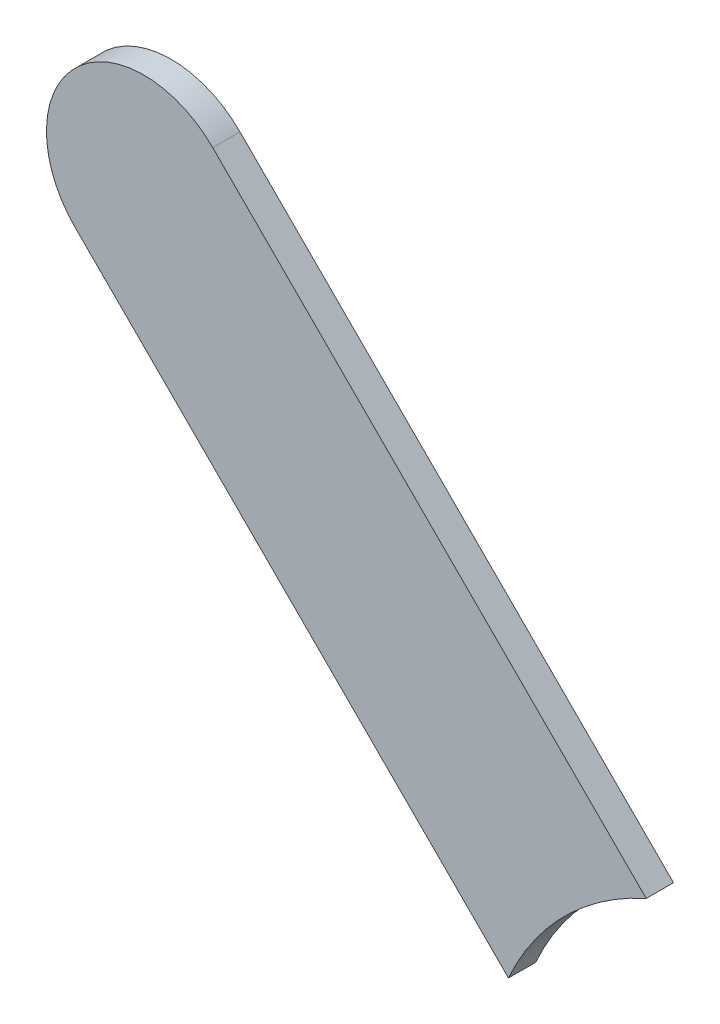
ISO-10303-21;
HEADER;
FILE_DESCRIPTION(('STEP AP214'),'2;1');
FILE_NAME('part.step','',(''),(''),'','','');
FILE_SCHEMA(('AUTOMOTIVE_DESIGN { 1 0 10303 214 1 1 1 1 }'));
ENDSEC;
DATA;
#1=APPLICATION_CONTEXT('core data for automotive mechanical design processes');
#2=APPLICATION_PROTOCOL_DEFINITION('international standard','automotive_design',2000,#1);
#3=PRODUCT_CONTEXT('',#1,'mechanical');
#4=PRODUCT('Part','Part','',(#3));
#5=PRODUCT_RELATED_PRODUCT_CATEGORY('part','',(#4));
#6=PRODUCT_DEFINITION_FORMATION('','',#4);
#7=PRODUCT_DEFINITION_CONTEXT('part definition',#1,'design');
#8=PRODUCT_DEFINITION('design','',#6,#7);
#9=PRODUCT_DEFINITION_SHAPE('','',#8);
#10=(LENGTH_UNIT() NAMED_UNIT(*) SI_UNIT(.MILLI.,.METRE.));
#11=(NAMED_UNIT(*) PLANE_ANGLE_UNIT() SI_UNIT($,.RADIAN.));
#12=(NAMED_UNIT(*) SI_UNIT($,.STERADIAN.) SOLID_ANGLE_UNIT());
#13=UNCERTAINTY_MEASURE_WITH_UNIT(LENGTH_MEASURE(1.E-05),#10,'distance_accuracy_value','');
#14=(GEOMETRIC_REPRESENTATION_CONTEXT(3) GLOBAL_UNCERTAINTY_ASSIGNED_CONTEXT((#13)) GLOBAL_UNIT_ASSIGNED_CONTEXT((#10,
#11,#12)) REPRESENTATION_CONTEXT('',''));
#15=CARTESIAN_POINT('',(0.,0.,0.));
#16=DIRECTION('',(0.,0.,1.));
#17=DIRECTION('',(1.,0.,0.));
#18=AXIS2_PLACEMENT_3D('',#15,#16,#17);
#19=CARTESIAN_POINT('',(95.1772163,83.4472169,0.));
#20=DIRECTION('',(0.707106781186554,0.707106781186541,0.));
#21=DIRECTION('',(0.707106781186541,-0.707106781186554,0.));
#22=AXIS2_PLACEMENT_3D('',#19,#20,#21);
#23=PLANE('',#22);
#24=DIRECTION('',(0.707106781186541,-0.707106781186554,0.));
#25=VECTOR('',#24,1.);
#26=CARTESIAN_POINT('',(95.1772163,83.4472169,0.03556));
#27=LINE('',#26,#25);
#28=CARTESIAN_POINT('',(95.1772163,83.4472169,0.03556));
#29=VERTEX_POINT('',#28);
#30=CARTESIAN_POINT('',(95.7423527371965,82.8820804628034,0.03556));
#31=VERTEX_POINT('',#30);
#32=EDGE_CURVE('E11',#29,#31,#27,.T.);
#33=ORIENTED_EDGE('',*,*,#32,.F.);
#34=DIRECTION('',(0.,0.,1.));
#35=VECTOR('',#34,1.);
#36=CARTESIAN_POINT('',(95.1772163,83.4472169,0.));
#37=LINE('',#36,#35);
#38=CARTESIAN_POINT('',(95.1772163,83.4472169,0.));
#39=VERTEX_POINT('',#38);
#40=EDGE_CURVE('E24',#39,#29,#37,.T.);
#41=ORIENTED_EDGE('',*,*,#40,.F.);
#42=DIRECTION('',(0.707106781186541,-0.707106781186554,0.));
#43=VECTOR('',#42,1.);
#44=CARTESIAN_POINT('',(95.1772163,83.4472169,0.));
#45=LINE('',#44,#43);
#46=CARTESIAN_POINT('',(95.7423527371965,82.8820804628034,0.));
#47=VERTEX_POINT('',#46);
#48=EDGE_CURVE('E75',#39,#47,#45,.T.);
#49=ORIENTED_EDGE('',*,*,#48,.T.);
#50=DIRECTION('',(0.,0.,1.));
#51=VECTOR('',#50,1.);
#52=CARTESIAN_POINT('',(95.7423527371965,82.8820804628034,0.));
#53=LINE('',#52,#51);
#54=EDGE_CURVE('E37',#47,#31,#53,.T.);
#55=ORIENTED_EDGE('',*,*,#54,.T.);
#56=EDGE_LOOP('',(#33,#41,#49,#55));
#57=FACE_BOUND('',#56,.T.);
#58=ADVANCED_FACE('F17',(#57),#23,.F.);
#59=CARTESIAN_POINT('',(96.06701894,82.73701766,0.));
#60=DIRECTION('',(0.,0.,-1.));
#61=DIRECTION('',(1.,0.,0.));
#62=AXIS2_PLACEMENT_3D('',#59,#60,#61);
#63=CYLINDRICAL_SURFACE('',#62,0.3556);
#64=DIRECTION('',(0.,0.,1.));
#65=VECTOR('',#64,1.);
#66=CARTESIAN_POINT('',(95.9219596483949,83.0616854316051,0.));
#67=LINE('',#66,#65);
#68=CARTESIAN_POINT('',(95.9219596483949,83.0616854316051,0.));
#69=VERTEX_POINT('',#68);
#70=CARTESIAN_POINT('',(95.9219596483949,83.0616854316051,0.03556));
#71=VERTEX_POINT('',#70);
#72=EDGE_CURVE('E67',#69,#71,#67,.T.);
#73=ORIENTED_EDGE('',*,*,#72,.T.);
#74=CARTESIAN_POINT('',(96.06701894,82.73701766,0.03556));
#75=DIRECTION('',(0.,0.,1.));
#76=DIRECTION('',(1.,0.,0.));
#77=AXIS2_PLACEMENT_3D('',#74,#75,#76);
#78=CIRCLE('',#77,0.3556);
#79=EDGE_CURVE('E82',#71,#31,#78,.T.);
#80=ORIENTED_EDGE('',*,*,#79,.T.);
#81=ORIENTED_EDGE('',*,*,#54,.F.);
#82=CARTESIAN_POINT('',(96.06701894,82.73701766,0.));
#83=DIRECTION('',(0.,0.,1.));
#84=DIRECTION('',(1.,0.,0.));
#85=AXIS2_PLACEMENT_3D('',#82,#83,#84);
#86=CIRCLE('',#85,0.3556);
#87=EDGE_CURVE('E80',#69,#47,#86,.T.);
#88=ORIENTED_EDGE('',*,*,#87,.F.);
#89=EDGE_LOOP('',(#73,#80,#81,#88));
#90=FACE_BOUND('',#89,.T.);
#91=ADVANCED_FACE('F88',(#90),#63,.F.);
#92=CARTESIAN_POINT('',(95.9219596483949,83.0616854316051,0.));
#93=DIRECTION('',(-0.707106781186554,-0.707106781186541,0.));
#94=DIRECTION('',(-0.707106781186541,0.707106781186554,0.));
#95=AXIS2_PLACEMENT_3D('',#92,#93,#94);
#96=PLANE('',#95);
#97=DIRECTION('',(-0.707106781186541,0.707106781186554,0.));
#98=VECTOR('',#97,1.);
#99=CARTESIAN_POINT('',(96.15682318,82.8268219,0.03556));
#100=LINE('',#99,#98);
#101=CARTESIAN_POINT('',(95.35682224,83.62682284,0.03556));
#102=VERTEX_POINT('',#101);
#103=EDGE_CURVE('E71',#71,#102,#100,.T.);
#104=ORIENTED_EDGE('',*,*,#103,.F.);
#105=ORIENTED_EDGE('',*,*,#72,.F.);
#106=DIRECTION('',(-0.707106781186541,0.707106781186554,0.));
#107=VECTOR('',#106,1.);
#108=CARTESIAN_POINT('',(96.15682318,82.8268219,0.));
#109=LINE('',#108,#107);
#110=CARTESIAN_POINT('',(95.35682224,83.62682284,0.));
#111=VERTEX_POINT('',#110);
#112=EDGE_CURVE('E63',#69,#111,#109,.T.);
#113=ORIENTED_EDGE('',*,*,#112,.T.);
#114=DIRECTION('',(0.,0.,1.));
#115=VECTOR('',#114,1.);
#116=CARTESIAN_POINT('',(95.35682224,83.62682284,0.));
#117=LINE('',#116,#115);
#118=EDGE_CURVE('E53',#111,#102,#117,.T.);
#119=ORIENTED_EDGE('',*,*,#118,.T.);
#120=EDGE_LOOP('',(#104,#105,#113,#119));
#121=FACE_BOUND('',#120,.T.);
#122=ADVANCED_FACE('F66',(#121),#96,.F.);
#123=CARTESIAN_POINT('',(95.26701927,83.53701987,0.));
#124=DIRECTION('',(0.,0.,-1.));
#125=DIRECTION('',(0.707106781186548,0.707106781186548,0.));
#126=AXIS2_PLACEMENT_3D('',#123,#124,#125);
#127=CYLINDRICAL_SURFACE('',#126,0.127000578115386);
#128=CARTESIAN_POINT('',(95.26701927,83.53701987,0.03556));
#129=DIRECTION('',(0.,0.,1.));
#130=DIRECTION('',(0.707106781186548,0.707106781186548,0.));
#131=AXIS2_PLACEMENT_3D('',#128,#129,#130);
#132=CIRCLE('',#131,0.127000578115386);
#133=EDGE_CURVE('E59',#102,#29,#132,.T.);
#134=ORIENTED_EDGE('',*,*,#133,.F.);
#135=ORIENTED_EDGE('',*,*,#118,.F.);
#136=CARTESIAN_POINT('',(95.26701927,83.53701987,0.));
#137=DIRECTION('',(0.,0.,1.));
#138=DIRECTION('',(0.707106781186548,0.707106781186548,0.));
#139=AXIS2_PLACEMENT_3D('',#136,#137,#138);
#140=CIRCLE('',#139,0.127000578115386);
#141=EDGE_CURVE('E57',#111,#39,#140,.T.);
#142=ORIENTED_EDGE('',*,*,#141,.T.);
#143=ORIENTED_EDGE('',*,*,#40,.T.);
#144=EDGE_LOOP('',(#134,#135,#142,#143));
#145=FACE_BOUND('',#144,.T.);
#146=ADVANCED_FACE('F55',(#145),#127,.T.);
#147=CARTESIAN_POINT('',(95.1772163,83.4472169,0.));
#148=DIRECTION('',(0.,0.,-1.));
#149=DIRECTION('',(-1.,0.,0.));
#150=AXIS2_PLACEMENT_3D('',#147,#148,#149);
#151=PLANE('',#150);
#152=ORIENTED_EDGE('',*,*,#48,.F.);
#153=ORIENTED_EDGE('',*,*,#141,.F.);
#154=ORIENTED_EDGE('',*,*,#112,.F.);
#155=ORIENTED_EDGE('',*,*,#87,.T.);
#156=EDGE_LOOP('',(#152,#153,#154,#155));
#157=FACE_BOUND('',#156,.T.);
#158=ADVANCED_FACE('F74',(#157),#151,.T.);
#159=CARTESIAN_POINT('',(95.1772163,83.4472169,0.03556));
#160=DIRECTION('',(0.,0.,-1.));
#161=DIRECTION('',(-1.,0.,0.));
#162=AXIS2_PLACEMENT_3D('',#159,#160,#161);
#163=PLANE('',#162);
#164=ORIENTED_EDGE('',*,*,#133,.T.);
#165=ORIENTED_EDGE('',*,*,#32,.T.);
#166=ORIENTED_EDGE('',*,*,#79,.F.);
#167=ORIENTED_EDGE('',*,*,#103,.T.);
#168=EDGE_LOOP('',(#164,#165,#166,#167));
#169=FACE_BOUND('',#168,.T.);
#170=ADVANCED_FACE('F91',(#169),#163,.F.);
#171=CLOSED_SHELL('',(#58,#91,#122,#146,#158,#170));
#172=MANIFOLD_SOLID_BREP('B1',#171);
#173=ADVANCED_BREP_SHAPE_REPRESENTATION('',(#18,#172),#14);
#174=SHAPE_DEFINITION_REPRESENTATION(#9,#173);
ENDSEC;
END-ISO-10303-21;
